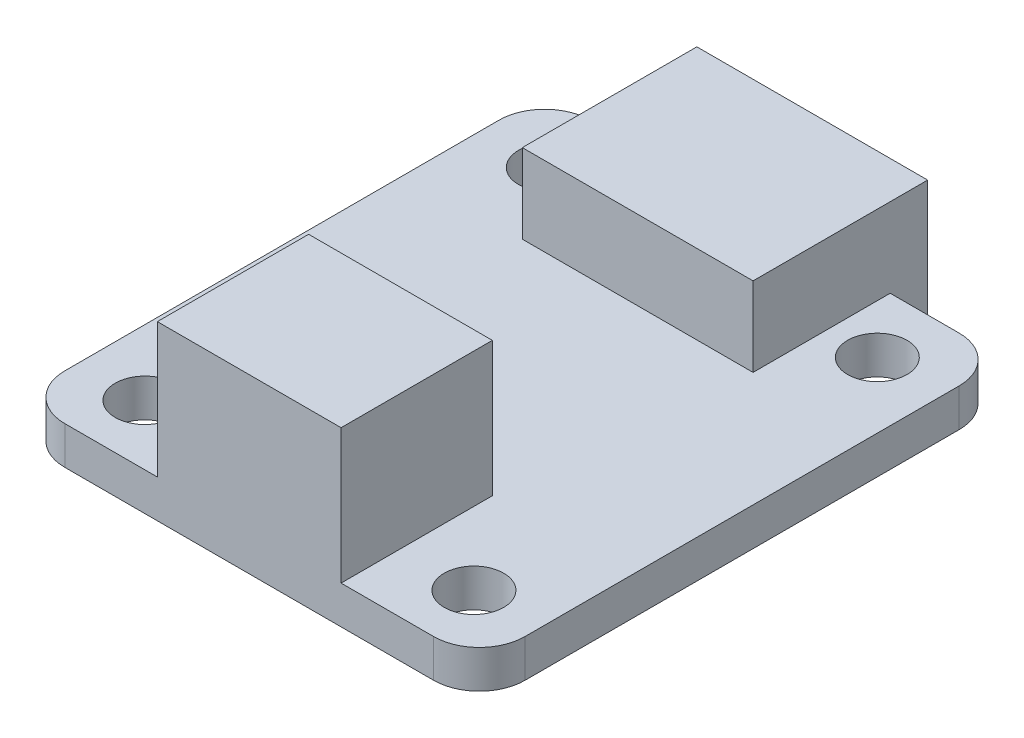
ISO-10303-21;
HEADER;
FILE_DESCRIPTION(('STEP AP214'),'2;1');
FILE_NAME('part.step','',(''),(''),'','','');
FILE_SCHEMA(('AUTOMOTIVE_DESIGN { 1 0 10303 214 1 1 1 1 }'));
ENDSEC;
DATA;
#1=APPLICATION_CONTEXT('core data for automotive mechanical design processes');
#2=APPLICATION_PROTOCOL_DEFINITION('international standard','automotive_design',2000,#1);
#3=PRODUCT_CONTEXT('',#1,'mechanical');
#4=PRODUCT('Part','Part','',(#3));
#5=PRODUCT_RELATED_PRODUCT_CATEGORY('part','',(#4));
#6=PRODUCT_DEFINITION_FORMATION('','',#4);
#7=PRODUCT_DEFINITION_CONTEXT('part definition',#1,'design');
#8=PRODUCT_DEFINITION('design','',#6,#7);
#9=PRODUCT_DEFINITION_SHAPE('','',#8);
#10=(LENGTH_UNIT() NAMED_UNIT(*) SI_UNIT(.MILLI.,.METRE.));
#11=(NAMED_UNIT(*) PLANE_ANGLE_UNIT() SI_UNIT($,.RADIAN.));
#12=(NAMED_UNIT(*) SI_UNIT($,.STERADIAN.) SOLID_ANGLE_UNIT());
#13=UNCERTAINTY_MEASURE_WITH_UNIT(LENGTH_MEASURE(1.E-05),#10,'distance_accuracy_value','');
#14=(GEOMETRIC_REPRESENTATION_CONTEXT(3) GLOBAL_UNCERTAINTY_ASSIGNED_CONTEXT((#13)) GLOBAL_UNIT_ASSIGNED_CONTEXT((#10,
#11,#12)) REPRESENTATION_CONTEXT('',''));
#15=CARTESIAN_POINT('',(0.,0.,0.));
#16=DIRECTION('',(0.,0.,1.));
#17=DIRECTION('',(1.,0.,0.));
#18=AXIS2_PLACEMENT_3D('',#15,#16,#17);
#19=CARTESIAN_POINT('',(-10.07,1.66,-11.6789883268482));
#20=DIRECTION('',(0.,0.,1.));
#21=DIRECTION('',(1.,0.,0.));
#22=AXIS2_PLACEMENT_3D('',#19,#20,#21);
#23=PLANE('',#22);
#24=DIRECTION('',(-1.,0.,0.));
#25=VECTOR('',#24,1.);
#26=CARTESIAN_POINT('',(-10.07,1.66,-11.6789883268482));
#27=LINE('',#26,#25);
#28=CARTESIAN_POINT('',(8.07,1.66,-11.6789883268482));
#29=VERTEX_POINT('',#28);
#30=CARTESIAN_POINT('',(5.05,1.66,-11.6789883268482));
#31=VERTEX_POINT('',#30);
#32=EDGE_CURVE('E262',#29,#31,#27,.T.);
#33=ORIENTED_EDGE('',*,*,#32,.F.);
#34=DIRECTION('',(0.,-1.,0.));
#35=VECTOR('',#34,1.);
#36=CARTESIAN_POINT('',(8.07,1.66,-11.6789883268482));
#37=LINE('',#36,#35);
#38=CARTESIAN_POINT('',(8.07,0.,-11.6789883268482));
#39=VERTEX_POINT('',#38);
#40=EDGE_CURVE('E300',#29,#39,#37,.T.);
#41=ORIENTED_EDGE('',*,*,#40,.T.);
#42=DIRECTION('',(-1.,0.,0.));
#43=VECTOR('',#42,1.);
#44=CARTESIAN_POINT('',(-10.07,0.,-11.6789883268482));
#45=LINE('',#44,#43);
#46=CARTESIAN_POINT('',(5.05,0.,-11.6789883268482));
#47=VERTEX_POINT('',#46);
#48=EDGE_CURVE('E256',#39,#47,#45,.T.);
#49=ORIENTED_EDGE('',*,*,#48,.T.);
#50=DIRECTION('',(0.,1.,0.));
#51=VECTOR('',#50,1.);
#52=CARTESIAN_POINT('',(5.05,1.66,-11.6789883268482));
#53=LINE('',#52,#51);
#54=EDGE_CURVE('E215',#47,#31,#53,.T.);
#55=ORIENTED_EDGE('',*,*,#54,.T.);
#56=EDGE_LOOP('',(#33,#41,#49,#55));
#57=FACE_BOUND('',#56,.T.);
#58=ADVANCED_FACE('F35',(#57),#23,.F.);
#59=CARTESIAN_POINT('',(-10.07,1.66,-11.6789883268482));
#60=DIRECTION('',(1.,0.,0.));
#61=DIRECTION('',(0.,0.,-1.));
#62=AXIS2_PLACEMENT_3D('',#59,#60,#61);
#63=PLANE('',#62);
#64=DIRECTION('',(0.,0.,1.));
#65=VECTOR('',#64,1.);
#66=CARTESIAN_POINT('',(-10.07,1.66,-11.6789883268482));
#67=LINE('',#66,#65);
#68=CARTESIAN_POINT('',(-10.07,1.66,-9.67898832684825));
#69=VERTEX_POINT('',#68);
#70=CARTESIAN_POINT('',(-10.07,1.66,9.32101167315175));
#71=VERTEX_POINT('',#70);
#72=EDGE_CURVE('E252',#69,#71,#67,.T.);
#73=ORIENTED_EDGE('',*,*,#72,.F.);
#74=DIRECTION('',(0.,-1.,0.));
#75=VECTOR('',#74,1.);
#76=CARTESIAN_POINT('',(-10.07,1.66,-9.67898832684825));
#77=LINE('',#76,#75);
#78=CARTESIAN_POINT('',(-10.07,0.,-9.67898832684825));
#79=VERTEX_POINT('',#78);
#80=EDGE_CURVE('E275',#69,#79,#77,.T.);
#81=ORIENTED_EDGE('',*,*,#80,.T.);
#82=DIRECTION('',(0.,0.,1.));
#83=VECTOR('',#82,1.);
#84=CARTESIAN_POINT('',(-10.07,0.,-11.6789883268482));
#85=LINE('',#84,#83);
#86=CARTESIAN_POINT('',(-10.07,0.,9.32101167315175));
#87=VERTEX_POINT('',#86);
#88=EDGE_CURVE('E251',#79,#87,#85,.T.);
#89=ORIENTED_EDGE('',*,*,#88,.T.);
#90=DIRECTION('',(0.,-1.,0.));
#91=VECTOR('',#90,1.);
#92=CARTESIAN_POINT('',(-10.07,1.66,9.32101167315175));
#93=LINE('',#92,#91);
#94=EDGE_CURVE('E264',#87,#71,#93,.F.);
#95=ORIENTED_EDGE('',*,*,#94,.T.);
#96=EDGE_LOOP('',(#73,#81,#89,#95));
#97=FACE_BOUND('',#96,.T.);
#98=ADVANCED_FACE('F339',(#97),#63,.F.);
#99=CARTESIAN_POINT('',(-10.07,1.66,11.3210116731518));
#100=DIRECTION('',(0.,0.,-1.));
#101=DIRECTION('',(-1.,0.,0.));
#102=AXIS2_PLACEMENT_3D('',#99,#100,#101);
#103=PLANE('',#102);
#104=DIRECTION('',(1.,0.,0.));
#105=VECTOR('',#104,1.);
#106=CARTESIAN_POINT('',(-10.07,1.66,11.3210116731518));
#107=LINE('',#106,#105);
#108=CARTESIAN_POINT('',(-8.07,1.66,11.3210116731518));
#109=VERTEX_POINT('',#108);
#110=CARTESIAN_POINT('',(-4.02,1.66,11.3210116731518));
#111=VERTEX_POINT('',#110);
#112=EDGE_CURVE('E257',#109,#111,#107,.T.);
#113=ORIENTED_EDGE('',*,*,#112,.F.);
#114=DIRECTION('',(0.,-1.,0.));
#115=VECTOR('',#114,1.);
#116=CARTESIAN_POINT('',(-8.07,1.66,11.3210116731518));
#117=LINE('',#116,#115);
#118=CARTESIAN_POINT('',(-8.07,0.,11.3210116731518));
#119=VERTEX_POINT('',#118);
#120=EDGE_CURVE('E297',#109,#119,#117,.T.);
#121=ORIENTED_EDGE('',*,*,#120,.T.);
#122=DIRECTION('',(1.,0.,0.));
#123=VECTOR('',#122,1.);
#124=CARTESIAN_POINT('',(-10.07,0.,11.3210116731518));
#125=LINE('',#124,#123);
#126=CARTESIAN_POINT('',(8.06999999999999,0.,11.3210116731518));
#127=VERTEX_POINT('',#126);
#128=EDGE_CURVE('E267',#119,#127,#125,.T.);
#129=ORIENTED_EDGE('',*,*,#128,.T.);
#130=DIRECTION('',(0.,-1.,0.));
#131=VECTOR('',#130,1.);
#132=CARTESIAN_POINT('',(8.06999999999999,1.66,11.3210116731518));
#133=LINE('',#132,#131);
#134=CARTESIAN_POINT('',(8.06999999999999,1.66,11.3210116731518));
#135=VERTEX_POINT('',#134);
#136=EDGE_CURVE('E295',#127,#135,#133,.F.);
#137=ORIENTED_EDGE('',*,*,#136,.T.);
#138=CARTESIAN_POINT('',(4.02,1.66,11.3210116731518));
#139=VERTEX_POINT('',#138);
#140=EDGE_CURVE('E255',#139,#135,#107,.T.);
#141=ORIENTED_EDGE('',*,*,#140,.F.);
#142=DIRECTION('',(0.,-1.,0.));
#143=VECTOR('',#142,1.);
#144=CARTESIAN_POINT('',(4.02,7.55,11.3210116731518));
#145=LINE('',#144,#143);
#146=CARTESIAN_POINT('',(4.02,7.55,11.3210116731518));
#147=VERTEX_POINT('',#146);
#148=EDGE_CURVE('E235',#147,#139,#145,.T.);
#149=ORIENTED_EDGE('',*,*,#148,.F.);
#150=DIRECTION('',(-1.,0.,0.));
#151=VECTOR('',#150,1.);
#152=CARTESIAN_POINT('',(-4.02,7.55,11.3210116731518));
#153=LINE('',#152,#151);
#154=CARTESIAN_POINT('',(-4.02,7.55,11.3210116731518));
#155=VERTEX_POINT('',#154);
#156=EDGE_CURVE('E227',#147,#155,#153,.T.);
#157=ORIENTED_EDGE('',*,*,#156,.T.);
#158=DIRECTION('',(0.,-1.,0.));
#159=VECTOR('',#158,1.);
#160=CARTESIAN_POINT('',(-4.02,7.55,11.3210116731518));
#161=LINE('',#160,#159);
#162=EDGE_CURVE('E231',#155,#111,#161,.T.);
#163=ORIENTED_EDGE('',*,*,#162,.T.);
#164=EDGE_LOOP('',(#113,#121,#129,#137,#141,#149,#157,#163));
#165=FACE_BOUND('',#164,.T.);
#166=ADVANCED_FACE('F346',(#165),#103,.F.);
#167=CARTESIAN_POINT('',(10.07,1.66,-11.6789883268482));
#168=DIRECTION('',(-1.,0.,0.));
#169=DIRECTION('',(0.,0.,1.));
#170=AXIS2_PLACEMENT_3D('',#167,#168,#169);
#171=PLANE('',#170);
#172=DIRECTION('',(0.,0.,-1.));
#173=VECTOR('',#172,1.);
#174=CARTESIAN_POINT('',(10.07,0.,-11.6789883268482));
#175=LINE('',#174,#173);
#176=CARTESIAN_POINT('',(10.07,0.,9.32101167315175));
#177=VERTEX_POINT('',#176);
#178=CARTESIAN_POINT('',(10.07,0.,-9.67898832684825));
#179=VERTEX_POINT('',#178);
#180=EDGE_CURVE('E270',#177,#179,#175,.T.);
#181=ORIENTED_EDGE('',*,*,#180,.T.);
#182=DIRECTION('',(0.,-1.,0.));
#183=VECTOR('',#182,1.);
#184=CARTESIAN_POINT('',(10.07,1.66,-9.67898832684825));
#185=LINE('',#184,#183);
#186=CARTESIAN_POINT('',(10.07,1.66,-9.67898832684825));
#187=VERTEX_POINT('',#186);
#188=EDGE_CURVE('E11',#179,#187,#185,.F.);
#189=ORIENTED_EDGE('',*,*,#188,.T.);
#190=DIRECTION('',(0.,0.,-1.));
#191=VECTOR('',#190,1.);
#192=CARTESIAN_POINT('',(10.07,1.66,-11.6789883268482));
#193=LINE('',#192,#191);
#194=CARTESIAN_POINT('',(10.07,1.66,9.32101167315175));
#195=VERTEX_POINT('',#194);
#196=EDGE_CURVE('E259',#195,#187,#193,.T.);
#197=ORIENTED_EDGE('',*,*,#196,.F.);
#198=DIRECTION('',(0.,-1.,0.));
#199=VECTOR('',#198,1.);
#200=CARTESIAN_POINT('',(10.07,1.66,9.32101167315175));
#201=LINE('',#200,#199);
#202=EDGE_CURVE('E43',#195,#177,#201,.T.);
#203=ORIENTED_EDGE('',*,*,#202,.T.);
#204=EDGE_LOOP('',(#181,#189,#197,#203));
#205=FACE_BOUND('',#204,.T.);
#206=ADVANCED_FACE('F305',(#205),#171,.F.);
#207=CARTESIAN_POINT('',(-5.05,0.,-11.6789883268482));
#208=VERTEX_POINT('',#207);
#209=CARTESIAN_POINT('',(-8.07,0.,-11.6789883268482));
#210=VERTEX_POINT('',#209);
#211=EDGE_CURVE('E272',#208,#210,#45,.T.);
#212=ORIENTED_EDGE('',*,*,#211,.T.);
#213=DIRECTION('',(0.,-1.,0.));
#214=VECTOR('',#213,1.);
#215=CARTESIAN_POINT('',(-8.07,1.66,-11.6789883268482));
#216=LINE('',#215,#214);
#217=CARTESIAN_POINT('',(-8.07,1.66,-11.6789883268482));
#218=VERTEX_POINT('',#217);
#219=EDGE_CURVE('E286',#210,#218,#216,.F.);
#220=ORIENTED_EDGE('',*,*,#219,.T.);
#221=CARTESIAN_POINT('',(-5.05,1.66,-11.6789883268482));
#222=VERTEX_POINT('',#221);
#223=EDGE_CURVE('E261',#222,#218,#27,.T.);
#224=ORIENTED_EDGE('',*,*,#223,.F.);
#225=DIRECTION('',(0.,-1.,0.));
#226=VECTOR('',#225,1.);
#227=CARTESIAN_POINT('',(-5.05,1.66,-11.6789883268482));
#228=LINE('',#227,#226);
#229=EDGE_CURVE('E211',#222,#208,#228,.T.);
#230=ORIENTED_EDGE('',*,*,#229,.T.);
#231=EDGE_LOOP('',(#212,#220,#224,#230));
#232=FACE_BOUND('',#231,.T.);
#233=ADVANCED_FACE('F331',(#232),#23,.F.);
#234=CARTESIAN_POINT('',(0.,1.66,0.));
#235=DIRECTION('',(0.,1.,0.));
#236=DIRECTION('',(0.,0.,1.));
#237=AXIS2_PLACEMENT_3D('',#234,#235,#236);
#238=PLANE('',#237);
#239=CARTESIAN_POINT('',(-7.2,1.66,-8.96594228929946));
#240=DIRECTION('',(0.,1.,0.));
#241=DIRECTION('',(0.,0.,1.));
#242=AXIS2_PLACEMENT_3D('',#239,#240,#241);
#243=CIRCLE('',#242,1.30000000000001);
#244=CARTESIAN_POINT('',(-7.2,1.66,-7.66594228929945));
#245=VERTEX_POINT('',#244);
#246=EDGE_CURVE('E601',#245,#245,#243,.T.);
#247=ORIENTED_EDGE('',*,*,#246,.F.);
#248=EDGE_LOOP('',(#247));
#249=FACE_BOUND('',#248,.T.);
#250=CARTESIAN_POINT('',(7.2,1.66,-8.96594228929946));
#251=DIRECTION('',(0.,1.,0.));
#252=DIRECTION('',(0.,0.,1.));
#253=AXIS2_PLACEMENT_3D('',#250,#251,#252);
#254=CIRCLE('',#253,1.30000000000001);
#255=CARTESIAN_POINT('',(7.2,1.66,-7.66594228929945));
#256=VERTEX_POINT('',#255);
#257=EDGE_CURVE('E603',#256,#256,#254,.T.);
#258=ORIENTED_EDGE('',*,*,#257,.F.);
#259=EDGE_LOOP('',(#258));
#260=FACE_BOUND('',#259,.T.);
#261=CARTESIAN_POINT('',(7.2,1.66,8.68646886990676));
#262=DIRECTION('',(0.,1.,0.));
#263=DIRECTION('',(0.,0.,1.));
#264=AXIS2_PLACEMENT_3D('',#261,#262,#263);
#265=CIRCLE('',#264,1.30000000000001);
#266=CARTESIAN_POINT('',(7.2,1.66,9.98646886990677));
#267=VERTEX_POINT('',#266);
#268=EDGE_CURVE('E611',#267,#267,#265,.T.);
#269=ORIENTED_EDGE('',*,*,#268,.F.);
#270=EDGE_LOOP('',(#269));
#271=FACE_BOUND('',#270,.T.);
#272=CARTESIAN_POINT('',(-7.2,1.66,8.68646886990676));
#273=DIRECTION('',(0.,1.,0.));
#274=DIRECTION('',(0.,0.,1.));
#275=AXIS2_PLACEMENT_3D('',#272,#273,#274);
#276=CIRCLE('',#275,1.30000000000001);
#277=CARTESIAN_POINT('',(-7.2,1.66,9.98646886990677));
#278=VERTEX_POINT('',#277);
#279=EDGE_CURVE('E616',#278,#278,#276,.T.);
#280=ORIENTED_EDGE('',*,*,#279,.F.);
#281=EDGE_LOOP('',(#280));
#282=FACE_BOUND('',#281,.T.);
#283=ORIENTED_EDGE('',*,*,#223,.T.);
#284=CARTESIAN_POINT('',(-8.07,1.66,-9.67898832684825));
#285=DIRECTION('',(0.,1.,0.));
#286=DIRECTION('',(0.,0.,1.));
#287=AXIS2_PLACEMENT_3D('',#284,#285,#286);
#288=CIRCLE('',#287,2.);
#289=EDGE_CURVE('E293',#218,#69,#288,.T.);
#290=ORIENTED_EDGE('',*,*,#289,.T.);
#291=ORIENTED_EDGE('',*,*,#72,.T.);
#292=CARTESIAN_POINT('',(-8.07,1.66,9.32101167315175));
#293=DIRECTION('',(0.,1.,0.));
#294=DIRECTION('',(0.,0.,1.));
#295=AXIS2_PLACEMENT_3D('',#292,#293,#294);
#296=CIRCLE('',#295,2.);
#297=EDGE_CURVE('E291',#71,#109,#296,.T.);
#298=ORIENTED_EDGE('',*,*,#297,.T.);
#299=ORIENTED_EDGE('',*,*,#112,.T.);
#300=DIRECTION('',(0.,0.,1.));
#301=VECTOR('',#300,1.);
#302=CARTESIAN_POINT('',(-4.02,1.66,0.));
#303=LINE('',#302,#301);
#304=CARTESIAN_POINT('',(-4.02,1.66,4.70101167315175));
#305=VERTEX_POINT('',#304);
#306=EDGE_CURVE('E248',#305,#111,#303,.T.);
#307=ORIENTED_EDGE('',*,*,#306,.F.);
#308=DIRECTION('',(-1.,0.,0.));
#309=VECTOR('',#308,1.);
#310=CARTESIAN_POINT('',(0.,1.66,4.70101167315175));
#311=LINE('',#310,#309);
#312=CARTESIAN_POINT('',(4.02,1.66,4.70101167315175));
#313=VERTEX_POINT('',#312);
#314=EDGE_CURVE('E234',#313,#305,#311,.T.);
#315=ORIENTED_EDGE('',*,*,#314,.F.);
#316=DIRECTION('',(0.,0.,-1.));
#317=VECTOR('',#316,1.);
#318=CARTESIAN_POINT('',(4.02,1.66,0.));
#319=LINE('',#318,#317);
#320=EDGE_CURVE('E245',#139,#313,#319,.T.);
#321=ORIENTED_EDGE('',*,*,#320,.F.);
#322=ORIENTED_EDGE('',*,*,#140,.T.);
#323=CARTESIAN_POINT('',(8.06999999999999,1.66,9.32101167315175));
#324=DIRECTION('',(0.,1.,0.));
#325=DIRECTION('',(0.,0.,1.));
#326=AXIS2_PLACEMENT_3D('',#323,#324,#325);
#327=CIRCLE('',#326,2.);
#328=EDGE_CURVE('E288',#135,#195,#327,.T.);
#329=ORIENTED_EDGE('',*,*,#328,.T.);
#330=ORIENTED_EDGE('',*,*,#196,.T.);
#331=CARTESIAN_POINT('',(8.07,1.66,-9.67898832684825));
#332=DIRECTION('',(0.,1.,0.));
#333=DIRECTION('',(0.,0.,1.));
#334=AXIS2_PLACEMENT_3D('',#331,#332,#333);
#335=CIRCLE('',#334,2.);
#336=EDGE_CURVE('E50',#187,#29,#335,.T.);
#337=ORIENTED_EDGE('',*,*,#336,.T.);
#338=ORIENTED_EDGE('',*,*,#32,.T.);
#339=DIRECTION('',(0.,0.,-1.));
#340=VECTOR('',#339,1.);
#341=CARTESIAN_POINT('',(5.05,1.66,0.));
#342=LINE('',#341,#340);
#343=CARTESIAN_POINT('',(5.05,1.66,-5.67898832684825));
#344=VERTEX_POINT('',#343);
#345=EDGE_CURVE('E213',#344,#31,#342,.T.);
#346=ORIENTED_EDGE('',*,*,#345,.F.);
#347=DIRECTION('',(1.,0.,0.));
#348=VECTOR('',#347,1.);
#349=CARTESIAN_POINT('',(0.,1.66,-5.67898832684825));
#350=LINE('',#349,#348);
#351=CARTESIAN_POINT('',(-5.05,1.66,-5.67898832684825));
#352=VERTEX_POINT('',#351);
#353=EDGE_CURVE('E166',#352,#344,#350,.T.);
#354=ORIENTED_EDGE('',*,*,#353,.F.);
#355=DIRECTION('',(0.,0.,1.));
#356=VECTOR('',#355,1.);
#357=CARTESIAN_POINT('',(-5.05,1.66,0.));
#358=LINE('',#357,#356);
#359=EDGE_CURVE('E208',#222,#352,#358,.T.);
#360=ORIENTED_EDGE('',*,*,#359,.F.);
#361=EDGE_LOOP('',(#283,#290,#291,#298,#299,#307,#315,#321,#322,#329,#330,#337,#338,#346,#354,#360));
#362=FACE_BOUND('',#361,.T.);
#363=ADVANCED_FACE('F318',(#249,#260,#271,#282,#362),#238,.T.);
#364=CARTESIAN_POINT('',(0.,0.,0.));
#365=DIRECTION('',(0.,1.,0.));
#366=DIRECTION('',(0.,0.,1.));
#367=AXIS2_PLACEMENT_3D('',#364,#365,#366);
#368=PLANE('',#367);
#369=CARTESIAN_POINT('',(-7.2,0.,-8.96594228929946));
#370=DIRECTION('',(0.,1.,0.));
#371=DIRECTION('',(0.,0.,1.));
#372=AXIS2_PLACEMENT_3D('',#369,#370,#371);
#373=CIRCLE('',#372,1.30000000000001);
#374=CARTESIAN_POINT('',(-7.2,0.,-7.66594228929945));
#375=VERTEX_POINT('',#374);
#376=EDGE_CURVE('E598',#375,#375,#373,.T.);
#377=ORIENTED_EDGE('',*,*,#376,.T.);
#378=EDGE_LOOP('',(#377));
#379=FACE_BOUND('',#378,.T.);
#380=CARTESIAN_POINT('',(7.2,0.,-8.96594228929946));
#381=DIRECTION('',(0.,1.,0.));
#382=DIRECTION('',(0.,0.,1.));
#383=AXIS2_PLACEMENT_3D('',#380,#381,#382);
#384=CIRCLE('',#383,1.30000000000001);
#385=CARTESIAN_POINT('',(7.2,0.,-7.66594228929945));
#386=VERTEX_POINT('',#385);
#387=EDGE_CURVE('E608',#386,#386,#384,.T.);
#388=ORIENTED_EDGE('',*,*,#387,.T.);
#389=EDGE_LOOP('',(#388));
#390=FACE_BOUND('',#389,.T.);
#391=CARTESIAN_POINT('',(7.2,0.,8.68646886990676));
#392=DIRECTION('',(0.,1.,0.));
#393=DIRECTION('',(0.,0.,1.));
#394=AXIS2_PLACEMENT_3D('',#391,#392,#393);
#395=CIRCLE('',#394,1.30000000000001);
#396=CARTESIAN_POINT('',(7.2,0.,9.98646886990677));
#397=VERTEX_POINT('',#396);
#398=EDGE_CURVE('E614',#397,#397,#395,.T.);
#399=ORIENTED_EDGE('',*,*,#398,.T.);
#400=EDGE_LOOP('',(#399));
#401=FACE_BOUND('',#400,.T.);
#402=CARTESIAN_POINT('',(-7.2,0.,8.68646886990676));
#403=DIRECTION('',(0.,1.,0.));
#404=DIRECTION('',(0.,0.,1.));
#405=AXIS2_PLACEMENT_3D('',#402,#403,#404);
#406=CIRCLE('',#405,1.30000000000001);
#407=CARTESIAN_POINT('',(-7.2,0.,9.98646886990677));
#408=VERTEX_POINT('',#407);
#409=EDGE_CURVE('E193',#408,#408,#406,.T.);
#410=ORIENTED_EDGE('',*,*,#409,.T.);
#411=EDGE_LOOP('',(#410));
#412=FACE_BOUND('',#411,.T.);
#413=ORIENTED_EDGE('',*,*,#88,.F.);
#414=CARTESIAN_POINT('',(-8.07,0.,-9.67898832684825));
#415=DIRECTION('',(0.,1.,0.));
#416=DIRECTION('',(0.,0.,1.));
#417=AXIS2_PLACEMENT_3D('',#414,#415,#416);
#418=CIRCLE('',#417,2.);
#419=EDGE_CURVE('E284',#79,#210,#418,.F.);
#420=ORIENTED_EDGE('',*,*,#419,.T.);
#421=ORIENTED_EDGE('',*,*,#211,.F.);
#422=DIRECTION('',(0.,0.,-1.));
#423=VECTOR('',#422,1.);
#424=CARTESIAN_POINT('',(-5.05,0.,-13.3189883268482));
#425=LINE('',#424,#423);
#426=CARTESIAN_POINT('',(-5.05,0.,-13.3189883268482));
#427=VERTEX_POINT('',#426);
#428=EDGE_CURVE('E190',#208,#427,#425,.T.);
#429=ORIENTED_EDGE('',*,*,#428,.T.);
#430=DIRECTION('',(1.,0.,0.));
#431=VECTOR('',#430,1.);
#432=CARTESIAN_POINT('',(5.05,0.,-13.3189883268482));
#433=LINE('',#432,#431);
#434=CARTESIAN_POINT('',(5.05,0.,-13.3189883268482));
#435=VERTEX_POINT('',#434);
#436=EDGE_CURVE('E187',#427,#435,#433,.T.);
#437=ORIENTED_EDGE('',*,*,#436,.T.);
#438=DIRECTION('',(0.,0.,1.));
#439=VECTOR('',#438,1.);
#440=CARTESIAN_POINT('',(5.05,0.,-13.3189883268482));
#441=LINE('',#440,#439);
#442=EDGE_CURVE('E198',#435,#47,#441,.T.);
#443=ORIENTED_EDGE('',*,*,#442,.T.);
#444=ORIENTED_EDGE('',*,*,#48,.F.);
#445=CARTESIAN_POINT('',(8.07,0.,-9.67898832684825));
#446=DIRECTION('',(0.,1.,0.));
#447=DIRECTION('',(0.,0.,1.));
#448=AXIS2_PLACEMENT_3D('',#445,#446,#447);
#449=CIRCLE('',#448,2.);
#450=EDGE_CURVE('E280',#39,#179,#449,.F.);
#451=ORIENTED_EDGE('',*,*,#450,.T.);
#452=ORIENTED_EDGE('',*,*,#180,.F.);
#453=CARTESIAN_POINT('',(8.06999999999999,0.,9.32101167315175));
#454=DIRECTION('',(0.,1.,0.));
#455=DIRECTION('',(0.,0.,1.));
#456=AXIS2_PLACEMENT_3D('',#453,#454,#455);
#457=CIRCLE('',#456,2.);
#458=EDGE_CURVE('E278',#177,#127,#457,.F.);
#459=ORIENTED_EDGE('',*,*,#458,.T.);
#460=ORIENTED_EDGE('',*,*,#128,.F.);
#461=CARTESIAN_POINT('',(-8.07,0.,9.32101167315175));
#462=DIRECTION('',(0.,1.,0.));
#463=DIRECTION('',(0.,0.,1.));
#464=AXIS2_PLACEMENT_3D('',#461,#462,#463);
#465=CIRCLE('',#464,2.);
#466=EDGE_CURVE('E282',#119,#87,#465,.F.);
#467=ORIENTED_EDGE('',*,*,#466,.T.);
#468=EDGE_LOOP('',(#413,#420,#421,#429,#437,#443,#444,#451,#452,#459,#460,#467));
#469=FACE_BOUND('',#468,.T.);
#470=ADVANCED_FACE('F310',(#379,#390,#401,#412,#469),#368,.F.);
#471=CARTESIAN_POINT('',(-4.02,7.55,11.3210116731518));
#472=DIRECTION('',(-1.,0.,0.));
#473=DIRECTION('',(0.,0.,1.));
#474=AXIS2_PLACEMENT_3D('',#471,#472,#473);
#475=PLANE('',#474);
#476=DIRECTION('',(0.,-1.,0.));
#477=VECTOR('',#476,1.);
#478=CARTESIAN_POINT('',(-4.02,7.55,4.70101167315175));
#479=LINE('',#478,#477);
#480=CARTESIAN_POINT('',(-4.02,7.55,4.70101167315175));
#481=VERTEX_POINT('',#480);
#482=EDGE_CURVE('E230',#481,#305,#479,.T.);
#483=ORIENTED_EDGE('',*,*,#482,.T.);
#484=ORIENTED_EDGE('',*,*,#306,.T.);
#485=ORIENTED_EDGE('',*,*,#162,.F.);
#486=DIRECTION('',(0.,0.,-1.));
#487=VECTOR('',#486,1.);
#488=CARTESIAN_POINT('',(-4.02,7.55,11.3210116731518));
#489=LINE('',#488,#487);
#490=EDGE_CURVE('E218',#155,#481,#489,.T.);
#491=ORIENTED_EDGE('',*,*,#490,.T.);
#492=EDGE_LOOP('',(#483,#484,#485,#491));
#493=FACE_BOUND('',#492,.T.);
#494=ADVANCED_FACE('F350',(#493),#475,.T.);
#495=CARTESIAN_POINT('',(4.02,7.55,11.3210116731518));
#496=DIRECTION('',(1.,0.,0.));
#497=DIRECTION('',(0.,0.,-1.));
#498=AXIS2_PLACEMENT_3D('',#495,#496,#497);
#499=PLANE('',#498);
#500=ORIENTED_EDGE('',*,*,#148,.T.);
#501=ORIENTED_EDGE('',*,*,#320,.T.);
#502=DIRECTION('',(0.,-1.,0.));
#503=VECTOR('',#502,1.);
#504=CARTESIAN_POINT('',(4.02,7.55,4.70101167315175));
#505=LINE('',#504,#503);
#506=CARTESIAN_POINT('',(4.02,7.55,4.70101167315175));
#507=VERTEX_POINT('',#506);
#508=EDGE_CURVE('E238',#507,#313,#505,.T.);
#509=ORIENTED_EDGE('',*,*,#508,.F.);
#510=DIRECTION('',(0.,0.,1.));
#511=VECTOR('',#510,1.);
#512=CARTESIAN_POINT('',(4.02,7.55,11.3210116731518));
#513=LINE('',#512,#511);
#514=EDGE_CURVE('E224',#507,#147,#513,.T.);
#515=ORIENTED_EDGE('',*,*,#514,.T.);
#516=EDGE_LOOP('',(#500,#501,#509,#515));
#517=FACE_BOUND('',#516,.T.);
#518=ADVANCED_FACE('F360',(#517),#499,.T.);
#519=CARTESIAN_POINT('',(-4.02,7.55,4.70101167315175));
#520=DIRECTION('',(0.,0.,-1.));
#521=DIRECTION('',(-1.,0.,0.));
#522=AXIS2_PLACEMENT_3D('',#519,#520,#521);
#523=PLANE('',#522);
#524=ORIENTED_EDGE('',*,*,#508,.T.);
#525=ORIENTED_EDGE('',*,*,#314,.T.);
#526=ORIENTED_EDGE('',*,*,#482,.F.);
#527=DIRECTION('',(1.,0.,0.));
#528=VECTOR('',#527,1.);
#529=CARTESIAN_POINT('',(-4.02,7.55,4.70101167315175));
#530=LINE('',#529,#528);
#531=EDGE_CURVE('E221',#481,#507,#530,.T.);
#532=ORIENTED_EDGE('',*,*,#531,.T.);
#533=EDGE_LOOP('',(#524,#525,#526,#532));
#534=FACE_BOUND('',#533,.T.);
#535=ADVANCED_FACE('F356',(#534),#523,.T.);
#536=CARTESIAN_POINT('',(0.,7.55,0.));
#537=DIRECTION('',(0.,-1.,0.));
#538=DIRECTION('',(0.,0.,-1.));
#539=AXIS2_PLACEMENT_3D('',#536,#537,#538);
#540=PLANE('',#539);
#541=ORIENTED_EDGE('',*,*,#490,.F.);
#542=ORIENTED_EDGE('',*,*,#156,.F.);
#543=ORIENTED_EDGE('',*,*,#514,.F.);
#544=ORIENTED_EDGE('',*,*,#531,.F.);
#545=EDGE_LOOP('',(#541,#542,#543,#544));
#546=FACE_BOUND('',#545,.T.);
#547=ADVANCED_FACE('F353',(#546),#540,.F.);
#548=CARTESIAN_POINT('',(5.05,5.13,-13.3189883268482));
#549=DIRECTION('',(1.,0.,0.));
#550=DIRECTION('',(0.,0.,-1.));
#551=AXIS2_PLACEMENT_3D('',#548,#549,#550);
#552=PLANE('',#551);
#553=ORIENTED_EDGE('',*,*,#54,.F.);
#554=ORIENTED_EDGE('',*,*,#442,.F.);
#555=DIRECTION('',(0.,-1.,0.));
#556=VECTOR('',#555,1.);
#557=CARTESIAN_POINT('',(5.05,5.13,-13.3189883268482));
#558=LINE('',#557,#556);
#559=CARTESIAN_POINT('',(5.05,5.13,-13.3189883268482));
#560=VERTEX_POINT('',#559);
#561=EDGE_CURVE('E186',#560,#435,#558,.T.);
#562=ORIENTED_EDGE('',*,*,#561,.F.);
#563=DIRECTION('',(0.,0.,1.));
#564=VECTOR('',#563,1.);
#565=CARTESIAN_POINT('',(5.05,5.13,-13.3189883268482));
#566=LINE('',#565,#564);
#567=CARTESIAN_POINT('',(5.05,5.13,-5.67898832684825));
#568=VERTEX_POINT('',#567);
#569=EDGE_CURVE('E178',#560,#568,#566,.T.);
#570=ORIENTED_EDGE('',*,*,#569,.T.);
#571=DIRECTION('',(0.,-1.,0.));
#572=VECTOR('',#571,1.);
#573=CARTESIAN_POINT('',(5.05,5.13,-5.67898832684825));
#574=LINE('',#573,#572);
#575=EDGE_CURVE('E161',#568,#344,#574,.T.);
#576=ORIENTED_EDGE('',*,*,#575,.T.);
#577=ORIENTED_EDGE('',*,*,#345,.T.);
#578=EDGE_LOOP('',(#553,#554,#562,#570,#576,#577));
#579=FACE_BOUND('',#578,.T.);
#580=ADVANCED_FACE('F184',(#579),#552,.T.);
#581=CARTESIAN_POINT('',(-5.05,5.13,-13.3189883268482));
#582=DIRECTION('',(-1.,0.,0.));
#583=DIRECTION('',(0.,0.,1.));
#584=AXIS2_PLACEMENT_3D('',#581,#582,#583);
#585=PLANE('',#584);
#586=ORIENTED_EDGE('',*,*,#229,.F.);
#587=ORIENTED_EDGE('',*,*,#359,.T.);
#588=DIRECTION('',(0.,-1.,0.));
#589=VECTOR('',#588,1.);
#590=CARTESIAN_POINT('',(-5.05,5.13,-5.67898832684825));
#591=LINE('',#590,#589);
#592=CARTESIAN_POINT('',(-5.05,5.13,-5.67898832684825));
#593=VERTEX_POINT('',#592);
#594=EDGE_CURVE('E170',#593,#352,#591,.T.);
#595=ORIENTED_EDGE('',*,*,#594,.F.);
#596=DIRECTION('',(0.,0.,-1.));
#597=VECTOR('',#596,1.);
#598=CARTESIAN_POINT('',(-5.05,5.13,-13.3189883268482));
#599=LINE('',#598,#597);
#600=CARTESIAN_POINT('',(-5.05,5.13,-13.3189883268482));
#601=VERTEX_POINT('',#600);
#602=EDGE_CURVE('E181',#593,#601,#599,.T.);
#603=ORIENTED_EDGE('',*,*,#602,.T.);
#604=DIRECTION('',(0.,-1.,0.));
#605=VECTOR('',#604,1.);
#606=CARTESIAN_POINT('',(-5.05,5.13,-13.3189883268482));
#607=LINE('',#606,#605);
#608=EDGE_CURVE('E203',#601,#427,#607,.T.);
#609=ORIENTED_EDGE('',*,*,#608,.T.);
#610=ORIENTED_EDGE('',*,*,#428,.F.);
#611=EDGE_LOOP('',(#586,#587,#595,#603,#609,#610));
#612=FACE_BOUND('',#611,.T.);
#613=ADVANCED_FACE('F326',(#612),#585,.T.);
#614=CARTESIAN_POINT('',(5.05,5.13,-13.3189883268482));
#615=DIRECTION('',(0.,0.,-1.));
#616=DIRECTION('',(-1.,0.,0.));
#617=AXIS2_PLACEMENT_3D('',#614,#615,#616);
#618=PLANE('',#617);
#619=ORIENTED_EDGE('',*,*,#436,.F.);
#620=ORIENTED_EDGE('',*,*,#608,.F.);
#621=DIRECTION('',(1.,0.,0.));
#622=VECTOR('',#621,1.);
#623=CARTESIAN_POINT('',(5.05,5.13,-13.3189883268482));
#624=LINE('',#623,#622);
#625=EDGE_CURVE('E171',#601,#560,#624,.T.);
#626=ORIENTED_EDGE('',*,*,#625,.T.);
#627=ORIENTED_EDGE('',*,*,#561,.T.);
#628=EDGE_LOOP('',(#619,#620,#626,#627));
#629=FACE_BOUND('',#628,.T.);
#630=ADVANCED_FACE('F323',(#629),#618,.T.);
#631=CARTESIAN_POINT('',(5.05,5.13,-5.67898832684825));
#632=DIRECTION('',(0.,0.,1.));
#633=DIRECTION('',(1.,0.,0.));
#634=AXIS2_PLACEMENT_3D('',#631,#632,#633);
#635=PLANE('',#634);
#636=ORIENTED_EDGE('',*,*,#594,.T.);
#637=ORIENTED_EDGE('',*,*,#353,.T.);
#638=ORIENTED_EDGE('',*,*,#575,.F.);
#639=DIRECTION('',(-1.,0.,0.));
#640=VECTOR('',#639,1.);
#641=CARTESIAN_POINT('',(5.05,5.13,-5.67898832684825));
#642=LINE('',#641,#640);
#643=EDGE_CURVE('E165',#568,#593,#642,.T.);
#644=ORIENTED_EDGE('',*,*,#643,.T.);
#645=EDGE_LOOP('',(#636,#637,#638,#644));
#646=FACE_BOUND('',#645,.T.);
#647=ADVANCED_FACE('F164',(#646),#635,.T.);
#648=CARTESIAN_POINT('',(0.,5.13,0.));
#649=DIRECTION('',(0.,-1.,0.));
#650=DIRECTION('',(0.,0.,-1.));
#651=AXIS2_PLACEMENT_3D('',#648,#649,#650);
#652=PLANE('',#651);
#653=ORIENTED_EDGE('',*,*,#569,.F.);
#654=ORIENTED_EDGE('',*,*,#625,.F.);
#655=ORIENTED_EDGE('',*,*,#602,.F.);
#656=ORIENTED_EDGE('',*,*,#643,.F.);
#657=EDGE_LOOP('',(#653,#654,#655,#656));
#658=FACE_BOUND('',#657,.T.);
#659=ADVANCED_FACE('F176',(#658),#652,.F.);
#660=CARTESIAN_POINT('',(-8.07,1.66,-9.67898832684825));
#661=DIRECTION('',(0.,-1.,0.));
#662=DIRECTION('',(0.,0.,-1.));
#663=AXIS2_PLACEMENT_3D('',#660,#661,#662);
#664=CYLINDRICAL_SURFACE('',#663,2.);
#665=ORIENTED_EDGE('',*,*,#289,.F.);
#666=ORIENTED_EDGE('',*,*,#219,.F.);
#667=ORIENTED_EDGE('',*,*,#419,.F.);
#668=ORIENTED_EDGE('',*,*,#80,.F.);
#669=EDGE_LOOP('',(#665,#666,#667,#668));
#670=FACE_BOUND('',#669,.T.);
#671=ADVANCED_FACE('F334',(#670),#664,.T.);
#672=CARTESIAN_POINT('',(-8.07,1.66,9.32101167315175));
#673=DIRECTION('',(0.,-1.,0.));
#674=DIRECTION('',(0.,0.,-1.));
#675=AXIS2_PLACEMENT_3D('',#672,#673,#674);
#676=CYLINDRICAL_SURFACE('',#675,2.);
#677=ORIENTED_EDGE('',*,*,#297,.F.);
#678=ORIENTED_EDGE('',*,*,#94,.F.);
#679=ORIENTED_EDGE('',*,*,#466,.F.);
#680=ORIENTED_EDGE('',*,*,#120,.F.);
#681=EDGE_LOOP('',(#677,#678,#679,#680));
#682=FACE_BOUND('',#681,.T.);
#683=ADVANCED_FACE('F342',(#682),#676,.T.);
#684=CARTESIAN_POINT('',(8.07,1.66,-9.67898832684825));
#685=DIRECTION('',(0.,-1.,0.));
#686=DIRECTION('',(0.,0.,-1.));
#687=AXIS2_PLACEMENT_3D('',#684,#685,#686);
#688=CYLINDRICAL_SURFACE('',#687,2.);
#689=ORIENTED_EDGE('',*,*,#336,.F.);
#690=ORIENTED_EDGE('',*,*,#188,.F.);
#691=ORIENTED_EDGE('',*,*,#450,.F.);
#692=ORIENTED_EDGE('',*,*,#40,.F.);
#693=EDGE_LOOP('',(#689,#690,#691,#692));
#694=FACE_BOUND('',#693,.T.);
#695=ADVANCED_FACE('F315',(#694),#688,.T.);
#696=CARTESIAN_POINT('',(8.06999999999999,1.66,9.32101167315175));
#697=DIRECTION('',(0.,-1.,0.));
#698=DIRECTION('',(0.,0.,-1.));
#699=AXIS2_PLACEMENT_3D('',#696,#697,#698);
#700=CYLINDRICAL_SURFACE('',#699,2.);
#701=ORIENTED_EDGE('',*,*,#328,.F.);
#702=ORIENTED_EDGE('',*,*,#136,.F.);
#703=ORIENTED_EDGE('',*,*,#458,.F.);
#704=ORIENTED_EDGE('',*,*,#202,.F.);
#705=EDGE_LOOP('',(#701,#702,#703,#704));
#706=FACE_BOUND('',#705,.T.);
#707=ADVANCED_FACE('F37',(#706),#700,.T.);
#708=CARTESIAN_POINT('',(-7.2,1.66,8.68646886990676));
#709=DIRECTION('',(0.,1.,0.));
#710=DIRECTION('',(0.,0.,1.));
#711=AXIS2_PLACEMENT_3D('',#708,#709,#710);
#712=CYLINDRICAL_SURFACE('',#711,1.30000000000001);
#713=ORIENTED_EDGE('',*,*,#409,.F.);
#714=EDGE_LOOP('',(#713));
#715=FACE_BOUND('',#714,.T.);
#716=ORIENTED_EDGE('',*,*,#279,.T.);
#717=EDGE_LOOP('',(#716));
#718=FACE_BOUND('',#717,.T.);
#719=ADVANCED_FACE('F363',(#715,#718),#712,.F.);
#720=CARTESIAN_POINT('',(7.2,1.66,8.68646886990676));
#721=DIRECTION('',(0.,1.,0.));
#722=DIRECTION('',(0.,0.,1.));
#723=AXIS2_PLACEMENT_3D('',#720,#721,#722);
#724=CYLINDRICAL_SURFACE('',#723,1.30000000000001);
#725=ORIENTED_EDGE('',*,*,#398,.F.);
#726=EDGE_LOOP('',(#725));
#727=FACE_BOUND('',#726,.T.);
#728=ORIENTED_EDGE('',*,*,#268,.T.);
#729=EDGE_LOOP('',(#728));
#730=FACE_BOUND('',#729,.T.);
#731=ADVANCED_FACE('F368',(#727,#730),#724,.F.);
#732=CARTESIAN_POINT('',(7.2,1.66,-8.96594228929946));
#733=DIRECTION('',(0.,1.,0.));
#734=DIRECTION('',(0.,0.,1.));
#735=AXIS2_PLACEMENT_3D('',#732,#733,#734);
#736=CYLINDRICAL_SURFACE('',#735,1.30000000000001);
#737=ORIENTED_EDGE('',*,*,#387,.F.);
#738=EDGE_LOOP('',(#737));
#739=FACE_BOUND('',#738,.T.);
#740=ORIENTED_EDGE('',*,*,#257,.T.);
#741=EDGE_LOOP('',(#740));
#742=FACE_BOUND('',#741,.T.);
#743=ADVANCED_FACE('F441',(#739,#742),#736,.F.);
#744=CARTESIAN_POINT('',(-7.2,1.66,-8.96594228929946));
#745=DIRECTION('',(0.,1.,0.));
#746=DIRECTION('',(0.,0.,1.));
#747=AXIS2_PLACEMENT_3D('',#744,#745,#746);
#748=CYLINDRICAL_SURFACE('',#747,1.30000000000001);
#749=ORIENTED_EDGE('',*,*,#376,.F.);
#750=EDGE_LOOP('',(#749));
#751=FACE_BOUND('',#750,.T.);
#752=ORIENTED_EDGE('',*,*,#246,.T.);
#753=EDGE_LOOP('',(#752));
#754=FACE_BOUND('',#753,.T.);
#755=ADVANCED_FACE('F451',(#751,#754),#748,.F.);
#756=CLOSED_SHELL('',(#58,#98,#166,#206,#233,#363,#470,#494,#518,#535,#547,#580,#613,#630,#647,
#659,#671,#683,#695,#707,#719,#731,#743,#755));
#757=MANIFOLD_SOLID_BREP('B2',#756);
#758=ADVANCED_BREP_SHAPE_REPRESENTATION('',(#18,#757),#14);
#759=SHAPE_DEFINITION_REPRESENTATION(#9,#758);
ENDSEC;
END-ISO-10303-21;
